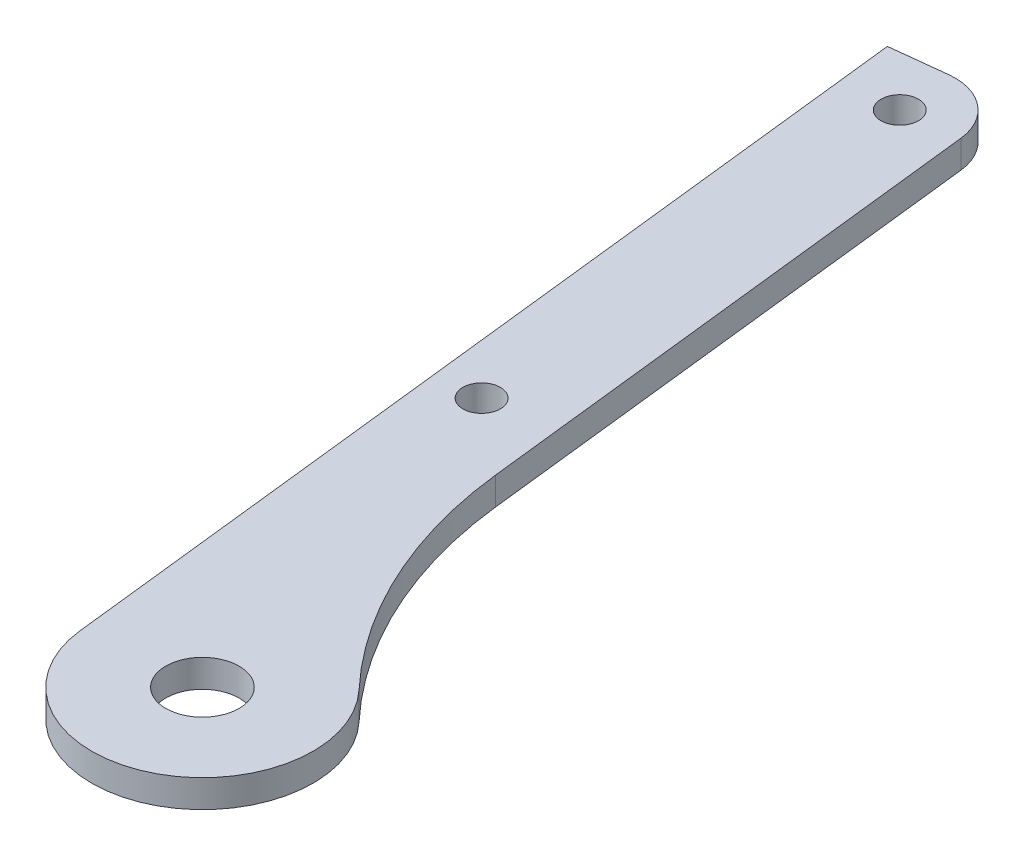
ISO-10303-21;
HEADER;
FILE_DESCRIPTION(('STEP AP214'),'2;1');
FILE_NAME('part.step','',(''),(''),'','','');
FILE_SCHEMA(('AUTOMOTIVE_DESIGN { 1 0 10303 214 1 1 1 1 }'));
ENDSEC;
DATA;
#1=APPLICATION_CONTEXT('core data for automotive mechanical design processes');
#2=APPLICATION_PROTOCOL_DEFINITION('international standard','automotive_design',2000,#1);
#3=PRODUCT_CONTEXT('',#1,'mechanical');
#4=PRODUCT('Part','Part','',(#3));
#5=PRODUCT_RELATED_PRODUCT_CATEGORY('part','',(#4));
#6=PRODUCT_DEFINITION_FORMATION('','',#4);
#7=PRODUCT_DEFINITION_CONTEXT('part definition',#1,'design');
#8=PRODUCT_DEFINITION('design','',#6,#7);
#9=PRODUCT_DEFINITION_SHAPE('','',#8);
#10=(LENGTH_UNIT() NAMED_UNIT(*) SI_UNIT(.MILLI.,.METRE.));
#11=(NAMED_UNIT(*) PLANE_ANGLE_UNIT() SI_UNIT($,.RADIAN.));
#12=(NAMED_UNIT(*) SI_UNIT($,.STERADIAN.) SOLID_ANGLE_UNIT());
#13=UNCERTAINTY_MEASURE_WITH_UNIT(LENGTH_MEASURE(1.E-05),#10,'distance_accuracy_value','');
#14=(GEOMETRIC_REPRESENTATION_CONTEXT(3) GLOBAL_UNCERTAINTY_ASSIGNED_CONTEXT((#13)) GLOBAL_UNIT_ASSIGNED_CONTEXT((#10,
#11,#12)) REPRESENTATION_CONTEXT('',''));
#15=CARTESIAN_POINT('',(0.,0.,0.));
#16=DIRECTION('',(0.,0.,1.));
#17=DIRECTION('',(1.,0.,0.));
#18=AXIS2_PLACEMENT_3D('',#15,#16,#17);
#19=CARTESIAN_POINT('',(-5.83025649484134,-9.8875,107.852119862031));
#20=DIRECTION('',(0.,-1.,0.));
#21=DIRECTION('',(0.,0.,-1.));
#22=AXIS2_PLACEMENT_3D('',#19,#20,#21);
#23=PLANE('',#22);
#24=CARTESIAN_POINT('',(0.,-9.8875,153.3144));
#25=DIRECTION('',(0.,1.,0.));
#26=DIRECTION('',(0.,0.,1.));
#27=AXIS2_PLACEMENT_3D('',#24,#25,#26);
#28=CIRCLE('',#27,4.2037);
#29=CARTESIAN_POINT('',(0.,-9.8875,157.5181));
#30=VERTEX_POINT('',#29);
#31=EDGE_CURVE('E138',#30,#30,#28,.F.);
#32=ORIENTED_EDGE('',*,*,#31,.T.);
#33=EDGE_LOOP('',(#32));
#34=FACE_BOUND('',#33,.T.);
#35=CARTESIAN_POINT('',(-17.3400495431374,-9.8875,56.0398397293865));
#36=DIRECTION('',(0.,1.,0.));
#37=DIRECTION('',(0.,0.,1.));
#38=AXIS2_PLACEMENT_3D('',#35,#36,#37);
#39=CIRCLE('',#38,2.1463);
#40=CARTESIAN_POINT('',(-17.3400495431374,-9.8875,58.1861397293865));
#41=VERTEX_POINT('',#40);
#42=EDGE_CURVE('E142',#41,#41,#39,.F.);
#43=ORIENTED_EDGE('',*,*,#42,.T.);
#44=EDGE_LOOP('',(#43));
#45=FACE_BOUND('',#44,.T.);
#46=CARTESIAN_POINT('',(-12.7000000000016,-9.8875,108.613413739759));
#47=DIRECTION('',(0.,1.,0.));
#48=DIRECTION('',(0.,0.,1.));
#49=AXIS2_PLACEMENT_3D('',#46,#47,#48);
#50=CIRCLE('',#49,2.1463);
#51=CARTESIAN_POINT('',(-12.7000000000016,-9.8875,110.759713739759));
#52=VERTEX_POINT('',#51);
#53=EDGE_CURVE('E146',#52,#52,#50,.F.);
#54=ORIENTED_EDGE('',*,*,#53,.T.);
#55=EDGE_LOOP('',(#54));
#56=FACE_BOUND('',#55,.T.);
#57=CARTESIAN_POINT('',(-17.3400495431374,-9.8875,56.0398397293865));
#58=DIRECTION('',(0.,1.,0.));
#59=DIRECTION('',(0.,0.,1.));
#60=AXIS2_PLACEMENT_3D('',#57,#58,#59);
#61=CIRCLE('',#60,6.35000000532595);
#62=CARTESIAN_POINT('',(-18.05036637228,-9.8875,49.7296931328423));
#63=VERTEX_POINT('',#62);
#64=CARTESIAN_POINT('',(-11.0299029442451,-9.8875,55.3295229211048));
#65=VERTEX_POINT('',#64);
#66=EDGE_CURVE('E20',#63,#65,#61,.F.);
#67=ORIENTED_EDGE('',*,*,#66,.F.);
#68=DIRECTION('',(-0.99372387305475,0.,0.111860914179472));
#69=VECTOR('',#68,1.);
#70=CARTESIAN_POINT('',(-18.0503663957872,-9.8875,49.7296931354885));
#71=LINE('',#70,#69);
#72=CARTESIAN_POINT('',(-24.3605129896851,-9.8875,50.4400099405281));
#73=VERTEX_POINT('',#72);
#74=EDGE_CURVE('E83',#73,#63,#71,.F.);
#75=ORIENTED_EDGE('',*,*,#74,.F.);
#76=DIRECTION('',(0.111860914179471,0.,0.99372387305475));
#77=VECTOR('',#76,1.);
#78=CARTESIAN_POINT('',(-24.3605129896851,-9.8875,50.4400099405282));
#79=LINE('',#78,#77);
#80=CARTESIAN_POINT('',(-12.6202931877977,-9.8875,154.73503361008));
#81=VERTEX_POINT('',#80);
#82=EDGE_CURVE('E107',#81,#73,#79,.F.);
#83=ORIENTED_EDGE('',*,*,#82,.F.);
#84=CARTESIAN_POINT('',(0.,-9.8875,153.3144));
#85=DIRECTION('',(0.,1.,0.));
#86=DIRECTION('',(0.,0.,1.));
#87=AXIS2_PLACEMENT_3D('',#84,#85,#86);
#88=CIRCLE('',#87,12.7000000000024);
#89=CARTESIAN_POINT('',(9.24385438808821,-9.8875,144.605717203395));
#90=VERTEX_POINT('',#89);
#91=EDGE_CURVE('E150',#90,#81,#88,.F.);
#92=ORIENTED_EDGE('',*,*,#91,.F.);
#93=CARTESIAN_POINT('',(46.2192720151027,-9.8875,109.770985985687));
#94=DIRECTION('',(0.,1.,0.));
#95=DIRECTION('',(0.,0.,1.));
#96=AXIS2_PLACEMENT_3D('',#93,#94,#95);
#97=CIRCLE('',#96,50.8000000758078);
#98=CARTESIAN_POINT('',(-4.26190079467241,-9.8875,115.4535204326));
#99=VERTEX_POINT('',#98);
#100=EDGE_CURVE('E154',#90,#99,#97,.F.);
#101=ORIENTED_EDGE('',*,*,#100,.T.);
#102=DIRECTION('',(-0.111860914179472,0.,-0.99372387305475));
#103=VECTOR('',#102,1.);
#104=CARTESIAN_POINT('',(-4.26190077793415,-9.8875,115.453520430716));
#105=LINE('',#104,#103);
#106=EDGE_CURVE('E85',#65,#99,#105,.F.);
#107=ORIENTED_EDGE('',*,*,#106,.F.);
#108=EDGE_LOOP('',(#67,#75,#83,#92,#101,#107));
#109=FACE_BOUND('',#108,.T.);
#110=ADVANCED_FACE('F17',(#34,#45,#56,#109),#23,.F.);
#111=CARTESIAN_POINT('',(-17.3400495431374,-13.0625,56.0398397293865));
#112=DIRECTION('',(0.,1.,0.));
#113=DIRECTION('',(0.,0.,1.));
#114=AXIS2_PLACEMENT_3D('',#111,#112,#113);
#115=CYLINDRICAL_SURFACE('',#114,6.35000000532595);
#116=CARTESIAN_POINT('',(-17.3400495431374,-13.0625,56.0398397293865));
#117=DIRECTION('',(0.,1.,0.));
#118=DIRECTION('',(0.,0.,1.));
#119=AXIS2_PLACEMENT_3D('',#116,#117,#118);
#120=CIRCLE('',#119,6.35000000532595);
#121=CARTESIAN_POINT('',(-18.05036637228,-13.0625,49.7296931328423));
#122=VERTEX_POINT('',#121);
#123=CARTESIAN_POINT('',(-11.0299029440473,-13.0625,55.3295229228615));
#124=VERTEX_POINT('',#123);
#125=EDGE_CURVE('E93',#122,#124,#120,.F.);
#126=ORIENTED_EDGE('',*,*,#125,.F.);
#127=DIRECTION('',(0.,1.,0.));
#128=VECTOR('',#127,1.);
#129=CARTESIAN_POINT('',(-18.0503663957872,-13.0625,49.7296931354885));
#130=LINE('',#129,#128);
#131=EDGE_CURVE('E90',#63,#122,#130,.F.);
#132=ORIENTED_EDGE('',*,*,#131,.F.);
#133=ORIENTED_EDGE('',*,*,#66,.T.);
#134=DIRECTION('',(0.,1.,0.));
#135=VECTOR('',#134,1.);
#136=CARTESIAN_POINT('',(-11.0299029445429,-13.0625,55.3295229184585));
#137=LINE('',#136,#135);
#138=EDGE_CURVE('E116',#124,#65,#137,.T.);
#139=ORIENTED_EDGE('',*,*,#138,.F.);
#140=EDGE_LOOP('',(#126,#132,#133,#139));
#141=FACE_BOUND('',#140,.T.);
#142=ADVANCED_FACE('F91',(#141),#115,.T.);
#143=CARTESIAN_POINT('',(-4.26190077793415,-13.0625,115.453520430716));
#144=DIRECTION('',(0.99372387305475,0.,-0.111860914179472));
#145=DIRECTION('',(-0.111860914179472,0.,-0.99372387305475));
#146=AXIS2_PLACEMENT_3D('',#143,#144,#145);
#147=PLANE('',#146);
#148=DIRECTION('',(0.111860913626176,0.,0.993723873117033));
#149=VECTOR('',#148,1.);
#150=CARTESIAN_POINT('',(-11.0299029445429,-13.0625,55.3295229184585));
#151=LINE('',#150,#149);
#152=CARTESIAN_POINT('',(-4.26190081299263,-13.0625,115.453520420431));
#153=VERTEX_POINT('',#152);
#154=EDGE_CURVE('E135',#124,#153,#151,.T.);
#155=ORIENTED_EDGE('',*,*,#154,.F.);
#156=ORIENTED_EDGE('',*,*,#138,.T.);
#157=ORIENTED_EDGE('',*,*,#106,.T.);
#158=DIRECTION('',(0.,1.,0.));
#159=VECTOR('',#158,1.);
#160=CARTESIAN_POINT('',(-4.26190081141067,-13.0625,115.453520434484));
#161=LINE('',#160,#159);
#162=EDGE_CURVE('E155',#99,#153,#161,.F.);
#163=ORIENTED_EDGE('',*,*,#162,.T.);
#164=EDGE_LOOP('',(#155,#156,#157,#163));
#165=FACE_BOUND('',#164,.T.);
#166=ADVANCED_FACE('F233',(#165),#147,.T.);
#167=CARTESIAN_POINT('',(46.2192720151027,-13.0625,109.770985985687));
#168=DIRECTION('',(0.,1.,0.));
#169=DIRECTION('',(0.,0.,1.));
#170=AXIS2_PLACEMENT_3D('',#167,#168,#169);
#171=CYLINDRICAL_SURFACE('',#170,50.8000000758078);
#172=DIRECTION('',(0.,1.,0.));
#173=VECTOR('',#172,1.);
#174=CARTESIAN_POINT('',(9.24385438419,-13.0625,144.605717199257));
#175=LINE('',#174,#173);
#176=CARTESIAN_POINT('',(9.24385438808821,-13.0625,144.605717203395));
#177=VERTEX_POINT('',#176);
#178=EDGE_CURVE('E153',#177,#90,#175,.T.);
#179=ORIENTED_EDGE('',*,*,#178,.F.);
#180=CARTESIAN_POINT('',(46.2192720151027,-13.0625,109.770985985687));
#181=DIRECTION('',(0.,1.,0.));
#182=DIRECTION('',(0.,0.,1.));
#183=AXIS2_PLACEMENT_3D('',#180,#181,#182);
#184=CIRCLE('',#183,50.8000000758078);
#185=EDGE_CURVE('E131',#153,#177,#184,.T.);
#186=ORIENTED_EDGE('',*,*,#185,.F.);
#187=ORIENTED_EDGE('',*,*,#162,.F.);
#188=ORIENTED_EDGE('',*,*,#100,.F.);
#189=EDGE_LOOP('',(#179,#186,#187,#188));
#190=FACE_BOUND('',#189,.T.);
#191=ADVANCED_FACE('F175',(#190),#171,.F.);
#192=CARTESIAN_POINT('',(0.,-13.0625,153.3144));
#193=DIRECTION('',(0.,1.,0.));
#194=DIRECTION('',(0.,0.,1.));
#195=AXIS2_PLACEMENT_3D('',#192,#193,#194);
#196=CYLINDRICAL_SURFACE('',#195,12.7000000000024);
#197=CARTESIAN_POINT('',(0.,-13.0625,153.3144));
#198=DIRECTION('',(0.,1.,0.));
#199=DIRECTION('',(0.,0.,1.));
#200=AXIS2_PLACEMENT_3D('',#197,#198,#199);
#201=CIRCLE('',#200,12.7000000000024);
#202=CARTESIAN_POINT('',(-12.6202931877977,-13.0625,154.73503361008));
#203=VERTEX_POINT('',#202);
#204=EDGE_CURVE('E126',#177,#203,#201,.F.);
#205=ORIENTED_EDGE('',*,*,#204,.F.);
#206=ORIENTED_EDGE('',*,*,#178,.T.);
#207=ORIENTED_EDGE('',*,*,#91,.T.);
#208=DIRECTION('',(0.,1.,0.));
#209=VECTOR('',#208,1.);
#210=CARTESIAN_POINT('',(-12.6202931877977,-13.0625,154.73503361008));
#211=LINE('',#210,#209);
#212=EDGE_CURVE('E100',#203,#81,#211,.T.);
#213=ORIENTED_EDGE('',*,*,#212,.F.);
#214=EDGE_LOOP('',(#205,#206,#207,#213));
#215=FACE_BOUND('',#214,.T.);
#216=ADVANCED_FACE('F173',(#215),#196,.T.);
#217=CARTESIAN_POINT('',(-24.3605129896851,-13.0625,50.4400099405282));
#218=DIRECTION('',(-0.99372387305475,0.,0.111860914179471));
#219=DIRECTION('',(0.111860914179471,0.,0.99372387305475));
#220=AXIS2_PLACEMENT_3D('',#217,#218,#219);
#221=PLANE('',#220);
#222=DIRECTION('',(-0.11186091417947,0.,-0.99372387305475));
#223=VECTOR('',#222,1.);
#224=CARTESIAN_POINT('',(-12.6202931877977,-13.0625,154.73503361008));
#225=LINE('',#224,#223);
#226=CARTESIAN_POINT('',(-24.3605129896851,-13.0625,50.4400099405282));
#227=VERTEX_POINT('',#226);
#228=EDGE_CURVE('E130',#203,#227,#225,.T.);
#229=ORIENTED_EDGE('',*,*,#228,.F.);
#230=ORIENTED_EDGE('',*,*,#212,.T.);
#231=ORIENTED_EDGE('',*,*,#82,.T.);
#232=DIRECTION('',(0.,1.,0.));
#233=VECTOR('',#232,1.);
#234=CARTESIAN_POINT('',(-24.3605129896851,-13.0625,50.4400099405281));
#235=LINE('',#234,#233);
#236=EDGE_CURVE('E40',#227,#73,#235,.T.);
#237=ORIENTED_EDGE('',*,*,#236,.F.);
#238=EDGE_LOOP('',(#229,#230,#231,#237));
#239=FACE_BOUND('',#238,.T.);
#240=ADVANCED_FACE('F193',(#239),#221,.T.);
#241=CARTESIAN_POINT('',(-18.0503663957872,-13.0625,49.7296931354885));
#242=DIRECTION('',(-0.111860914179472,0.,-0.99372387305475));
#243=DIRECTION('',(-0.99372387305475,0.,0.111860914179472));
#244=AXIS2_PLACEMENT_3D('',#241,#242,#243);
#245=PLANE('',#244);
#246=DIRECTION('',(0.993723873054749,0.,-0.111860914179477));
#247=VECTOR('',#246,1.);
#248=CARTESIAN_POINT('',(-24.3605129896851,-13.0625,50.4400099405282));
#249=LINE('',#248,#247);
#250=EDGE_CURVE('E125',#227,#122,#249,.T.);
#251=ORIENTED_EDGE('',*,*,#250,.F.);
#252=ORIENTED_EDGE('',*,*,#236,.T.);
#253=ORIENTED_EDGE('',*,*,#74,.T.);
#254=ORIENTED_EDGE('',*,*,#131,.T.);
#255=EDGE_LOOP('',(#251,#252,#253,#254));
#256=FACE_BOUND('',#255,.T.);
#257=ADVANCED_FACE('F98',(#256),#245,.T.);
#258=CARTESIAN_POINT('',(-12.7000000000016,-2.85875000000017,108.613413739759));
#259=DIRECTION('',(0.,1.,0.));
#260=DIRECTION('',(0.,0.,1.));
#261=AXIS2_PLACEMENT_3D('',#258,#259,#260);
#262=CYLINDRICAL_SURFACE('',#261,2.1463);
#263=ORIENTED_EDGE('',*,*,#53,.F.);
#264=EDGE_LOOP('',(#263));
#265=FACE_BOUND('',#264,.T.);
#266=CARTESIAN_POINT('',(-12.7000000000016,-13.0625,108.613413739759));
#267=DIRECTION('',(0.,1.,0.));
#268=DIRECTION('',(0.,0.,1.));
#269=AXIS2_PLACEMENT_3D('',#266,#267,#268);
#270=CIRCLE('',#269,2.1463);
#271=CARTESIAN_POINT('',(-12.7000000000016,-13.0625,110.759713739759));
#272=VERTEX_POINT('',#271);
#273=EDGE_CURVE('E121',#272,#272,#270,.T.);
#274=ORIENTED_EDGE('',*,*,#273,.F.);
#275=EDGE_LOOP('',(#274));
#276=FACE_BOUND('',#275,.T.);
#277=ADVANCED_FACE('F201',(#265,#276),#262,.F.);
#278=CARTESIAN_POINT('',(-17.3400495431374,-2.85875000000017,56.0398397293865));
#279=DIRECTION('',(0.,1.,0.));
#280=DIRECTION('',(0.,0.,1.));
#281=AXIS2_PLACEMENT_3D('',#278,#279,#280);
#282=CYLINDRICAL_SURFACE('',#281,2.1463);
#283=ORIENTED_EDGE('',*,*,#42,.F.);
#284=EDGE_LOOP('',(#283));
#285=FACE_BOUND('',#284,.T.);
#286=CARTESIAN_POINT('',(-17.3400495431374,-13.0625,56.0398397293865));
#287=DIRECTION('',(0.,1.,0.));
#288=DIRECTION('',(0.,0.,1.));
#289=AXIS2_PLACEMENT_3D('',#286,#287,#288);
#290=CIRCLE('',#289,2.1463);
#291=CARTESIAN_POINT('',(-17.3400495431374,-13.0625,58.1861397293865));
#292=VERTEX_POINT('',#291);
#293=EDGE_CURVE('E27',#292,#292,#290,.T.);
#294=ORIENTED_EDGE('',*,*,#293,.F.);
#295=EDGE_LOOP('',(#294));
#296=FACE_BOUND('',#295,.T.);
#297=ADVANCED_FACE('F211',(#285,#296),#282,.F.);
#298=CARTESIAN_POINT('',(0.,-13.0625,153.3144));
#299=DIRECTION('',(0.,1.,0.));
#300=DIRECTION('',(0.,0.,1.));
#301=AXIS2_PLACEMENT_3D('',#298,#299,#300);
#302=CYLINDRICAL_SURFACE('',#301,4.2037);
#303=CARTESIAN_POINT('',(0.,-13.0625,153.3144));
#304=DIRECTION('',(0.,1.,0.));
#305=DIRECTION('',(0.,0.,1.));
#306=AXIS2_PLACEMENT_3D('',#303,#304,#305);
#307=CIRCLE('',#306,4.2037);
#308=CARTESIAN_POINT('',(0.,-13.0625,157.5181));
#309=VERTEX_POINT('',#308);
#310=EDGE_CURVE('E11',#309,#309,#307,.T.);
#311=ORIENTED_EDGE('',*,*,#310,.F.);
#312=EDGE_LOOP('',(#311));
#313=FACE_BOUND('',#312,.T.);
#314=ORIENTED_EDGE('',*,*,#31,.F.);
#315=EDGE_LOOP('',(#314));
#316=FACE_BOUND('',#315,.T.);
#317=ADVANCED_FACE('F205',(#313,#316),#302,.F.);
#318=CARTESIAN_POINT('',(-5.83025649484131,-13.0625,107.852119862031));
#319=DIRECTION('',(0.,-1.,0.));
#320=DIRECTION('',(0.,0.,-1.));
#321=AXIS2_PLACEMENT_3D('',#318,#319,#320);
#322=PLANE('',#321);
#323=ORIENTED_EDGE('',*,*,#310,.T.);
#324=EDGE_LOOP('',(#323));
#325=FACE_BOUND('',#324,.T.);
#326=ORIENTED_EDGE('',*,*,#293,.T.);
#327=EDGE_LOOP('',(#326));
#328=FACE_BOUND('',#327,.T.);
#329=ORIENTED_EDGE('',*,*,#273,.T.);
#330=EDGE_LOOP('',(#329));
#331=FACE_BOUND('',#330,.T.);
#332=ORIENTED_EDGE('',*,*,#228,.T.);
#333=ORIENTED_EDGE('',*,*,#250,.T.);
#334=ORIENTED_EDGE('',*,*,#125,.T.);
#335=ORIENTED_EDGE('',*,*,#154,.T.);
#336=ORIENTED_EDGE('',*,*,#185,.T.);
#337=ORIENTED_EDGE('',*,*,#204,.T.);
#338=EDGE_LOOP('',(#332,#333,#334,#335,#336,#337));
#339=FACE_BOUND('',#338,.T.);
#340=ADVANCED_FACE('F179',(#325,#328,#331,#339),#322,.T.);
#341=CLOSED_SHELL('',(#110,#142,#166,#191,#216,#240,#257,#277,#297,#317,#340));
#342=MANIFOLD_SOLID_BREP('B1',#341);
#343=ADVANCED_BREP_SHAPE_REPRESENTATION('',(#18,#342),#14);
#344=SHAPE_DEFINITION_REPRESENTATION(#9,#343);
ENDSEC;
END-ISO-10303-21;
